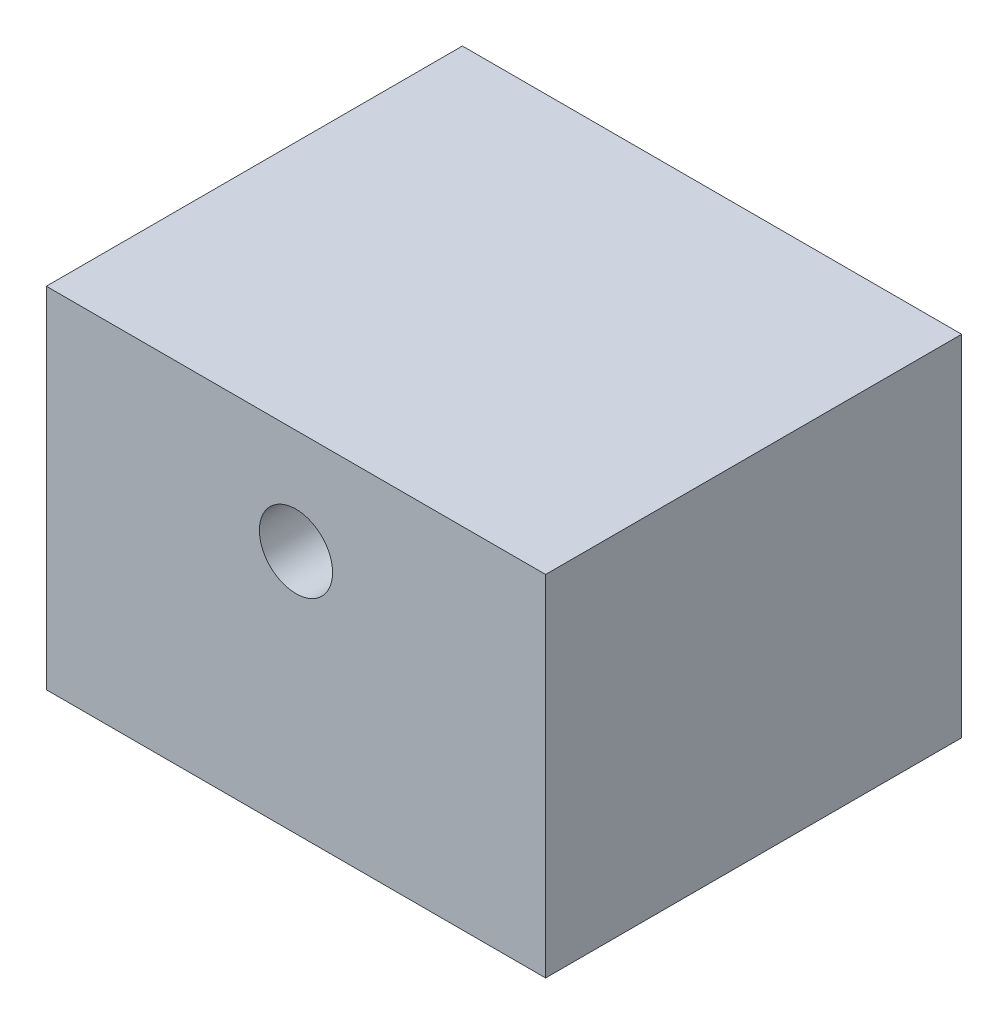
ISO-10303-21;
HEADER;
FILE_DESCRIPTION(('STEP AP214'),'2;1');
FILE_NAME('part.step','',(''),(''),'','','');
FILE_SCHEMA(('AUTOMOTIVE_DESIGN { 1 0 10303 214 1 1 1 1 }'));
ENDSEC;
DATA;
#1=APPLICATION_CONTEXT('core data for automotive mechanical design processes');
#2=APPLICATION_PROTOCOL_DEFINITION('international standard','automotive_design',2000,#1);
#3=PRODUCT_CONTEXT('',#1,'mechanical');
#4=PRODUCT('Part','Part','',(#3));
#5=PRODUCT_RELATED_PRODUCT_CATEGORY('part','',(#4));
#6=PRODUCT_DEFINITION_FORMATION('','',#4);
#7=PRODUCT_DEFINITION_CONTEXT('part definition',#1,'design');
#8=PRODUCT_DEFINITION('design','',#6,#7);
#9=PRODUCT_DEFINITION_SHAPE('','',#8);
#10=(LENGTH_UNIT() NAMED_UNIT(*) SI_UNIT(.MILLI.,.METRE.));
#11=(NAMED_UNIT(*) PLANE_ANGLE_UNIT() SI_UNIT($,.RADIAN.));
#12=(NAMED_UNIT(*) SI_UNIT($,.STERADIAN.) SOLID_ANGLE_UNIT());
#13=UNCERTAINTY_MEASURE_WITH_UNIT(LENGTH_MEASURE(1.E-05),#10,'distance_accuracy_value','');
#14=(GEOMETRIC_REPRESENTATION_CONTEXT(3) GLOBAL_UNCERTAINTY_ASSIGNED_CONTEXT((#13)) GLOBAL_UNIT_ASSIGNED_CONTEXT((#10,
#11,#12)) REPRESENTATION_CONTEXT('',''));
#15=CARTESIAN_POINT('',(0.,0.,0.));
#16=DIRECTION('',(0.,0.,1.));
#17=DIRECTION('',(1.,0.,0.));
#18=AXIS2_PLACEMENT_3D('',#15,#16,#17);
#19=CARTESIAN_POINT('',(0.,0.,12.5));
#20=DIRECTION('',(0.,0.,-1.));
#21=DIRECTION('',(-1.,0.,0.));
#22=AXIS2_PLACEMENT_3D('',#19,#20,#21);
#23=PLANE('',#22);
#24=DIRECTION('',(0.,-1.,0.));
#25=VECTOR('',#24,1.);
#26=CARTESIAN_POINT('',(0.,0.,12.5));
#27=LINE('',#26,#25);
#28=CARTESIAN_POINT('',(0.,21.,12.5));
#29=VERTEX_POINT('',#28);
#30=CARTESIAN_POINT('',(0.,0.,12.5));
#31=VERTEX_POINT('',#30);
#32=EDGE_CURVE('E90',#29,#31,#27,.T.);
#33=ORIENTED_EDGE('',*,*,#32,.T.);
#34=DIRECTION('',(1.,0.,0.));
#35=VECTOR('',#34,1.);
#36=CARTESIAN_POINT('',(0.,0.,12.5));
#37=LINE('',#36,#35);
#38=CARTESIAN_POINT('',(30.,0.,12.5));
#39=VERTEX_POINT('',#38);
#40=EDGE_CURVE('E85',#31,#39,#37,.T.);
#41=ORIENTED_EDGE('',*,*,#40,.T.);
#42=DIRECTION('',(0.,1.,0.));
#43=VECTOR('',#42,1.);
#44=CARTESIAN_POINT('',(30.,0.,12.5));
#45=LINE('',#44,#43);
#46=CARTESIAN_POINT('',(30.,21.,12.5));
#47=VERTEX_POINT('',#46);
#48=EDGE_CURVE('E88',#39,#47,#45,.T.);
#49=ORIENTED_EDGE('',*,*,#48,.T.);
#50=DIRECTION('',(-1.,0.,0.));
#51=VECTOR('',#50,1.);
#52=CARTESIAN_POINT('',(0.,21.,12.5));
#53=LINE('',#52,#51);
#54=EDGE_CURVE('E55',#47,#29,#53,.T.);
#55=ORIENTED_EDGE('',*,*,#54,.T.);
#56=EDGE_LOOP('',(#33,#41,#49,#55));
#57=FACE_BOUND('',#56,.T.);
#58=CARTESIAN_POINT('',(15.,14.7,12.5));
#59=DIRECTION('',(0.,0.,1.));
#60=DIRECTION('',(1.,0.,0.));
#61=AXIS2_PLACEMENT_3D('',#58,#59,#60);
#62=CIRCLE('',#61,2.2);
#63=CARTESIAN_POINT('',(17.2,14.7,12.5));
#64=VERTEX_POINT('',#63);
#65=EDGE_CURVE('E105',#64,#64,#62,.T.);
#66=ORIENTED_EDGE('',*,*,#65,.F.);
#67=EDGE_LOOP('',(#66));
#68=FACE_BOUND('',#67,.T.);
#69=ADVANCED_FACE('F38',(#57,#68),#23,.F.);
#70=CARTESIAN_POINT('',(0.,0.,-12.5));
#71=DIRECTION('',(0.,0.,-1.));
#72=DIRECTION('',(-1.,0.,0.));
#73=AXIS2_PLACEMENT_3D('',#70,#71,#72);
#74=PLANE('',#73);
#75=DIRECTION('',(0.,-1.,0.));
#76=VECTOR('',#75,1.);
#77=CARTESIAN_POINT('',(0.,0.,-12.5));
#78=LINE('',#77,#76);
#79=CARTESIAN_POINT('',(0.,21.,-12.5));
#80=VERTEX_POINT('',#79);
#81=CARTESIAN_POINT('',(0.,0.,-12.5));
#82=VERTEX_POINT('',#81);
#83=EDGE_CURVE('E102',#80,#82,#78,.T.);
#84=ORIENTED_EDGE('',*,*,#83,.F.);
#85=DIRECTION('',(-1.,0.,0.));
#86=VECTOR('',#85,1.);
#87=CARTESIAN_POINT('',(0.,21.,-12.5));
#88=LINE('',#87,#86);
#89=CARTESIAN_POINT('',(30.,21.,-12.5));
#90=VERTEX_POINT('',#89);
#91=EDGE_CURVE('E78',#90,#80,#88,.T.);
#92=ORIENTED_EDGE('',*,*,#91,.F.);
#93=DIRECTION('',(0.,1.,0.));
#94=VECTOR('',#93,1.);
#95=CARTESIAN_POINT('',(30.,0.,-12.5));
#96=LINE('',#95,#94);
#97=CARTESIAN_POINT('',(30.,0.,-12.5));
#98=VERTEX_POINT('',#97);
#99=EDGE_CURVE('E72',#98,#90,#96,.T.);
#100=ORIENTED_EDGE('',*,*,#99,.F.);
#101=DIRECTION('',(1.,0.,0.));
#102=VECTOR('',#101,1.);
#103=CARTESIAN_POINT('',(0.,0.,-12.5));
#104=LINE('',#103,#102);
#105=EDGE_CURVE('E94',#82,#98,#104,.T.);
#106=ORIENTED_EDGE('',*,*,#105,.F.);
#107=EDGE_LOOP('',(#84,#92,#100,#106));
#108=FACE_BOUND('',#107,.T.);
#109=CARTESIAN_POINT('',(15.,14.7,-12.5));
#110=DIRECTION('',(0.,0.,1.));
#111=DIRECTION('',(1.,0.,0.));
#112=AXIS2_PLACEMENT_3D('',#109,#110,#111);
#113=CIRCLE('',#112,2.2);
#114=CARTESIAN_POINT('',(17.2,14.7,-12.5));
#115=VERTEX_POINT('',#114);
#116=EDGE_CURVE('E117',#115,#115,#113,.T.);
#117=ORIENTED_EDGE('',*,*,#116,.T.);
#118=EDGE_LOOP('',(#117));
#119=FACE_BOUND('',#118,.T.);
#120=ADVANCED_FACE('F113',(#108,#119),#74,.T.);
#121=CARTESIAN_POINT('',(0.,0.,12.5));
#122=DIRECTION('',(1.,0.,0.));
#123=DIRECTION('',(0.,0.,-1.));
#124=AXIS2_PLACEMENT_3D('',#121,#122,#123);
#125=PLANE('',#124);
#126=ORIENTED_EDGE('',*,*,#83,.T.);
#127=DIRECTION('',(0.,0.,-1.));
#128=VECTOR('',#127,1.);
#129=CARTESIAN_POINT('',(0.,0.,12.5));
#130=LINE('',#129,#128);
#131=EDGE_CURVE('E11',#31,#82,#130,.T.);
#132=ORIENTED_EDGE('',*,*,#131,.F.);
#133=ORIENTED_EDGE('',*,*,#32,.F.);
#134=DIRECTION('',(0.,0.,-1.));
#135=VECTOR('',#134,1.);
#136=CARTESIAN_POINT('',(0.,21.,12.5));
#137=LINE('',#136,#135);
#138=EDGE_CURVE('E98',#29,#80,#137,.T.);
#139=ORIENTED_EDGE('',*,*,#138,.T.);
#140=EDGE_LOOP('',(#126,#132,#133,#139));
#141=FACE_BOUND('',#140,.T.);
#142=ADVANCED_FACE('F40',(#141),#125,.F.);
#143=CARTESIAN_POINT('',(0.,0.,12.5));
#144=DIRECTION('',(0.,1.,0.));
#145=DIRECTION('',(0.,0.,1.));
#146=AXIS2_PLACEMENT_3D('',#143,#144,#145);
#147=PLANE('',#146);
#148=ORIENTED_EDGE('',*,*,#105,.T.);
#149=DIRECTION('',(0.,0.,-1.));
#150=VECTOR('',#149,1.);
#151=CARTESIAN_POINT('',(30.,0.,12.5));
#152=LINE('',#151,#150);
#153=EDGE_CURVE('E47',#39,#98,#152,.T.);
#154=ORIENTED_EDGE('',*,*,#153,.F.);
#155=ORIENTED_EDGE('',*,*,#40,.F.);
#156=ORIENTED_EDGE('',*,*,#131,.T.);
#157=EDGE_LOOP('',(#148,#154,#155,#156));
#158=FACE_BOUND('',#157,.T.);
#159=ADVANCED_FACE('F93',(#158),#147,.F.);
#160=CARTESIAN_POINT('',(30.,0.,12.5));
#161=DIRECTION('',(-1.,0.,0.));
#162=DIRECTION('',(0.,0.,1.));
#163=AXIS2_PLACEMENT_3D('',#160,#161,#162);
#164=PLANE('',#163);
#165=ORIENTED_EDGE('',*,*,#99,.T.);
#166=DIRECTION('',(0.,0.,-1.));
#167=VECTOR('',#166,1.);
#168=CARTESIAN_POINT('',(30.,21.,12.5));
#169=LINE('',#168,#167);
#170=EDGE_CURVE('E95',#47,#90,#169,.T.);
#171=ORIENTED_EDGE('',*,*,#170,.F.);
#172=ORIENTED_EDGE('',*,*,#48,.F.);
#173=ORIENTED_EDGE('',*,*,#153,.T.);
#174=EDGE_LOOP('',(#165,#171,#172,#173));
#175=FACE_BOUND('',#174,.T.);
#176=ADVANCED_FACE('F96',(#175),#164,.F.);
#177=CARTESIAN_POINT('',(0.,21.,12.5));
#178=DIRECTION('',(0.,-1.,0.));
#179=DIRECTION('',(0.,0.,-1.));
#180=AXIS2_PLACEMENT_3D('',#177,#178,#179);
#181=PLANE('',#180);
#182=ORIENTED_EDGE('',*,*,#91,.T.);
#183=ORIENTED_EDGE('',*,*,#138,.F.);
#184=ORIENTED_EDGE('',*,*,#54,.F.);
#185=ORIENTED_EDGE('',*,*,#170,.T.);
#186=EDGE_LOOP('',(#182,#183,#184,#185));
#187=FACE_BOUND('',#186,.T.);
#188=ADVANCED_FACE('F110',(#187),#181,.F.);
#189=CARTESIAN_POINT('',(15.,14.7,12.5));
#190=DIRECTION('',(0.,0.,-1.));
#191=DIRECTION('',(-1.,0.,0.));
#192=AXIS2_PLACEMENT_3D('',#189,#190,#191);
#193=CYLINDRICAL_SURFACE('',#192,2.2);
#194=ORIENTED_EDGE('',*,*,#65,.T.);
#195=EDGE_LOOP('',(#194));
#196=FACE_BOUND('',#195,.T.);
#197=ORIENTED_EDGE('',*,*,#116,.F.);
#198=EDGE_LOOP('',(#197));
#199=FACE_BOUND('',#198,.T.);
#200=ADVANCED_FACE('F123',(#196,#199),#193,.F.);
#201=CLOSED_SHELL('',(#69,#120,#142,#159,#176,#188,#200));
#202=MANIFOLD_SOLID_BREP('B2',#201);
#203=ADVANCED_BREP_SHAPE_REPRESENTATION('',(#18,#202),#14);
#204=SHAPE_DEFINITION_REPRESENTATION(#9,#203);
ENDSEC;
END-ISO-10303-21;
